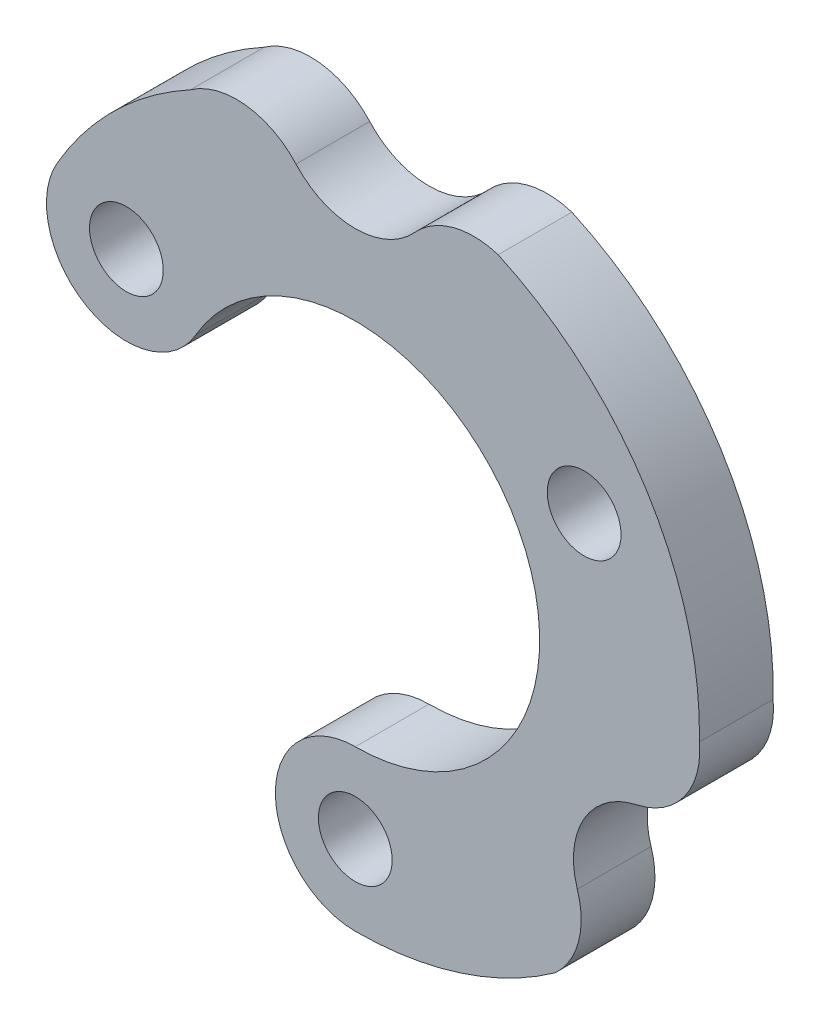
ISO-10303-21;
HEADER;
FILE_DESCRIPTION(('STEP AP214'),'2;1');
FILE_NAME('part.step','',(''),(''),'','','');
FILE_SCHEMA(('AUTOMOTIVE_DESIGN { 1 0 10303 214 1 1 1 1 }'));
ENDSEC;
DATA;
#1=APPLICATION_CONTEXT('core data for automotive mechanical design processes');
#2=APPLICATION_PROTOCOL_DEFINITION('international standard','automotive_design',2000,#1);
#3=PRODUCT_CONTEXT('',#1,'mechanical');
#4=PRODUCT('Part','Part','',(#3));
#5=PRODUCT_RELATED_PRODUCT_CATEGORY('part','',(#4));
#6=PRODUCT_DEFINITION_FORMATION('','',#4);
#7=PRODUCT_DEFINITION_CONTEXT('part definition',#1,'design');
#8=PRODUCT_DEFINITION('design','',#6,#7);
#9=PRODUCT_DEFINITION_SHAPE('','',#8);
#10=(LENGTH_UNIT() NAMED_UNIT(*) SI_UNIT(.MILLI.,.METRE.));
#11=(NAMED_UNIT(*) PLANE_ANGLE_UNIT() SI_UNIT($,.RADIAN.));
#12=(NAMED_UNIT(*) SI_UNIT($,.STERADIAN.) SOLID_ANGLE_UNIT());
#13=UNCERTAINTY_MEASURE_WITH_UNIT(LENGTH_MEASURE(1.E-05),#10,'distance_accuracy_value','');
#14=(GEOMETRIC_REPRESENTATION_CONTEXT(3) GLOBAL_UNCERTAINTY_ASSIGNED_CONTEXT((#13)) GLOBAL_UNIT_ASSIGNED_CONTEXT((#10,
#11,#12)) REPRESENTATION_CONTEXT('',''));
#15=CARTESIAN_POINT('',(0.,0.,0.));
#16=DIRECTION('',(0.,0.,1.));
#17=DIRECTION('',(1.,0.,0.));
#18=AXIS2_PLACEMENT_3D('',#15,#16,#17);
#19=CARTESIAN_POINT('',(5.38035373757222,-0.322325392410559,3.));
#20=DIRECTION('',(0.,0.,1.));
#21=DIRECTION('',(1.,0.,0.));
#22=AXIS2_PLACEMENT_3D('',#19,#20,#21);
#23=PLANE('',#22);
#24=CARTESIAN_POINT('',(0.,-10.75,3.));
#25=DIRECTION('',(0.,0.,1.));
#26=DIRECTION('',(1.,0.,0.));
#27=AXIS2_PLACEMENT_3D('',#24,#25,#26);
#28=CIRCLE('',#27,1.5);
#29=CARTESIAN_POINT('',(1.5,-10.75,3.));
#30=VERTEX_POINT('',#29);
#31=EDGE_CURVE('E286',#30,#30,#28,.T.);
#32=ORIENTED_EDGE('',*,*,#31,.F.);
#33=EDGE_LOOP('',(#32));
#34=FACE_BOUND('',#33,.T.);
#35=CARTESIAN_POINT('',(10.7607074751444,-0.644650784821117,3.));
#36=DIRECTION('',(0.,0.,1.));
#37=DIRECTION('',(1.,0.,0.));
#38=AXIS2_PLACEMENT_3D('',#35,#36,#37);
#39=CIRCLE('',#38,3.25);
#40=CARTESIAN_POINT('',(11.4425315640548,-3.82232539242045,3.));
#41=VERTEX_POINT('',#40);
#42=CARTESIAN_POINT('',(13.9959775932843,-0.335575935195618,3.));
#43=VERTEX_POINT('',#42);
#44=EDGE_CURVE('E177',#41,#43,#39,.T.);
#45=ORIENTED_EDGE('',*,*,#44,.T.);
#46=CARTESIAN_POINT('',(0.,0.,3.));
#47=DIRECTION('',(0.,0.,1.));
#48=DIRECTION('',(1.,0.,0.));
#49=AXIS2_PLACEMENT_3D('',#46,#47,#48);
#50=CIRCLE('',#49,14.);
#51=CARTESIAN_POINT('',(5.80943087987062,12.7377593340432,3.));
#52=VERTEX_POINT('',#51);
#53=EDGE_CURVE('E105',#43,#52,#50,.T.);
#54=ORIENTED_EDGE('',*,*,#53,.T.);
#55=CARTESIAN_POINT('',(4.82206978136234,9.64137142857136,3.));
#56=DIRECTION('',(0.,0.,1.));
#57=DIRECTION('',(1.,0.,0.));
#58=AXIS2_PLACEMENT_3D('',#55,#56,#57);
#59=CIRCLE('',#58,3.25);
#60=CARTESIAN_POINT('',(2.41103489067909,11.8206857142833,3.));
#61=VERTEX_POINT('',#60);
#62=EDGE_CURVE('E204',#52,#61,#59,.T.);
#63=ORIENTED_EDGE('',*,*,#62,.T.);
#64=CARTESIAN_POINT('',(1.07437023516552E-11,13.9999999999817,3.));
#65=DIRECTION('',(0.,0.,-1.));
#66=DIRECTION('',(1.,0.,0.));
#67=AXIS2_PLACEMENT_3D('',#64,#65,#66);
#68=CIRCLE('',#67,3.24999999997992);
#69=CARTESIAN_POINT('',(-2.41103489066096,11.820685714287,3.));
#70=VERTEX_POINT('',#69);
#71=EDGE_CURVE('E223',#61,#70,#68,.T.);
#72=ORIENTED_EDGE('',*,*,#71,.T.);
#73=CARTESIAN_POINT('',(-4.82206978134755,9.64137142857876,3.));
#74=DIRECTION('',(0.,0.,1.));
#75=DIRECTION('',(1.,0.,0.));
#76=AXIS2_PLACEMENT_3D('',#73,#74,#75);
#77=CIRCLE('',#76,3.25);
#78=CARTESIAN_POINT('',(-6.70737151186402,12.2886601141799,3.));
#79=VERTEX_POINT('',#78);
#80=EDGE_CURVE('E220',#70,#79,#77,.T.);
#81=ORIENTED_EDGE('',*,*,#80,.T.);
#82=CARTESIAN_POINT('',(0.,0.,3.));
#83=DIRECTION('',(0.,0.,1.));
#84=DIRECTION('',(1.,0.,0.));
#85=AXIS2_PLACEMENT_3D('',#82,#83,#84);
#86=CIRCLE('',#85,14.);
#87=CARTESIAN_POINT('',(-12.1243556529822,6.99999999999988,3.));
#88=VERTEX_POINT('',#87);
#89=EDGE_CURVE('E222',#79,#88,#86,.T.);
#90=ORIENTED_EDGE('',*,*,#89,.T.);
#91=CARTESIAN_POINT('',(-9.30977309068277,5.37499999999991,3.));
#92=DIRECTION('',(0.,0.,1.));
#93=DIRECTION('',(1.,0.,0.));
#94=AXIS2_PLACEMENT_3D('',#91,#92,#93);
#95=CIRCLE('',#94,3.25);
#96=CARTESIAN_POINT('',(-6.49519052838333,3.74999999999993,3.));
#97=VERTEX_POINT('',#96);
#98=EDGE_CURVE('E225',#88,#97,#95,.T.);
#99=ORIENTED_EDGE('',*,*,#98,.T.);
#100=CARTESIAN_POINT('',(0.,0.,3.));
#101=DIRECTION('',(0.,0.,-1.));
#102=DIRECTION('',(1.,0.,0.));
#103=AXIS2_PLACEMENT_3D('',#100,#101,#102);
#104=CIRCLE('',#103,7.5);
#105=CARTESIAN_POINT('',(0.,-7.5,3.));
#106=VERTEX_POINT('',#105);
#107=EDGE_CURVE('E231',#97,#106,#104,.T.);
#108=ORIENTED_EDGE('',*,*,#107,.T.);
#109=CARTESIAN_POINT('',(0.,-10.75,3.));
#110=DIRECTION('',(0.,0.,1.));
#111=DIRECTION('',(1.,0.,0.));
#112=AXIS2_PLACEMENT_3D('',#109,#110,#111);
#113=CIRCLE('',#112,3.25);
#114=CARTESIAN_POINT('',(0.,-14.,3.));
#115=VERTEX_POINT('',#114);
#116=EDGE_CURVE('E136',#106,#115,#113,.T.);
#117=ORIENTED_EDGE('',*,*,#116,.T.);
#118=CARTESIAN_POINT('',(0.,0.,3.));
#119=DIRECTION('',(0.,0.,1.));
#120=DIRECTION('',(1.,0.,0.));
#121=AXIS2_PLACEMENT_3D('',#118,#119,#120);
#122=CIRCLE('',#121,14.);
#123=CARTESIAN_POINT('',(8.12650773063849,-11.3999943905194,3.));
#124=VERTEX_POINT('',#123);
#125=EDGE_CURVE('E130',#115,#124,#122,.T.);
#126=ORIENTED_EDGE('',*,*,#125,.T.);
#127=CARTESIAN_POINT('',(5.93863769378309,-8.99672064376674,3.));
#128=DIRECTION('',(0.,0.,1.));
#129=DIRECTION('',(1.,0.,0.));
#130=AXIS2_PLACEMENT_3D('',#127,#128,#129);
#131=CIRCLE('',#130,3.25);
#132=CARTESIAN_POINT('',(9.03149667338157,-7.99836032188037,3.));
#133=VERTEX_POINT('',#132);
#134=EDGE_CURVE('E134',#124,#133,#131,.T.);
#135=ORIENTED_EDGE('',*,*,#134,.T.);
#136=CARTESIAN_POINT('',(12.124355652961,-7.00000000000017,3.));
#137=DIRECTION('',(0.,0.,-1.));
#138=DIRECTION('',(1.,0.,0.));
#139=AXIS2_PLACEMENT_3D('',#136,#137,#138);
#140=CIRCLE('',#139,3.24999999997994);
#141=EDGE_CURVE('E50',#133,#41,#140,.T.);
#142=ORIENTED_EDGE('',*,*,#141,.T.);
#143=EDGE_LOOP('',(#45,#54,#63,#72,#81,#90,#99,#108,#117,#126,#135,#142));
#144=FACE_BOUND('',#143,.T.);
#145=CARTESIAN_POINT('',(9.30977309068262,5.37500000000017,3.));
#146=DIRECTION('',(0.,0.,1.));
#147=DIRECTION('',(1.,0.,0.));
#148=AXIS2_PLACEMENT_3D('',#145,#146,#147);
#149=CIRCLE('',#148,1.5);
#150=CARTESIAN_POINT('',(10.8097730906826,5.37500000000017,3.));
#151=VERTEX_POINT('',#150);
#152=EDGE_CURVE('E158',#151,#151,#149,.T.);
#153=ORIENTED_EDGE('',*,*,#152,.F.);
#154=EDGE_LOOP('',(#153));
#155=FACE_BOUND('',#154,.T.);
#156=CARTESIAN_POINT('',(-9.30977309068277,5.37499999999991,3.));
#157=DIRECTION('',(0.,0.,1.));
#158=DIRECTION('',(1.,0.,0.));
#159=AXIS2_PLACEMENT_3D('',#156,#157,#158);
#160=CIRCLE('',#159,1.5);
#161=CARTESIAN_POINT('',(-7.80977309068277,5.37499999999991,3.));
#162=VERTEX_POINT('',#161);
#163=EDGE_CURVE('E277',#162,#162,#160,.T.);
#164=ORIENTED_EDGE('',*,*,#163,.F.);
#165=EDGE_LOOP('',(#164));
#166=FACE_BOUND('',#165,.T.);
#167=ADVANCED_FACE('F33',(#34,#144,#155,#166),#23,.T.);
#168=CARTESIAN_POINT('',(5.38035373757222,-0.322325392410559,0.));
#169=DIRECTION('',(0.,0.,1.));
#170=DIRECTION('',(1.,0.,0.));
#171=AXIS2_PLACEMENT_3D('',#168,#169,#170);
#172=PLANE('',#171);
#173=CARTESIAN_POINT('',(10.7607074751444,-0.644650784821117,0.));
#174=DIRECTION('',(0.,0.,1.));
#175=DIRECTION('',(1.,0.,0.));
#176=AXIS2_PLACEMENT_3D('',#173,#174,#175);
#177=CIRCLE('',#176,3.25);
#178=CARTESIAN_POINT('',(11.4425315640548,-3.82232539242045,0.));
#179=VERTEX_POINT('',#178);
#180=CARTESIAN_POINT('',(13.9959775932843,-0.335575935195618,0.));
#181=VERTEX_POINT('',#180);
#182=EDGE_CURVE('E154',#179,#181,#177,.T.);
#183=ORIENTED_EDGE('',*,*,#182,.F.);
#184=CARTESIAN_POINT('',(12.124355652961,-7.00000000000017,0.));
#185=DIRECTION('',(0.,0.,-1.));
#186=DIRECTION('',(1.,0.,0.));
#187=AXIS2_PLACEMENT_3D('',#184,#185,#186);
#188=CIRCLE('',#187,3.24999999997994);
#189=CARTESIAN_POINT('',(9.03149667338157,-7.99836032188037,0.));
#190=VERTEX_POINT('',#189);
#191=EDGE_CURVE('E97',#190,#179,#188,.T.);
#192=ORIENTED_EDGE('',*,*,#191,.F.);
#193=CARTESIAN_POINT('',(5.93863769378309,-8.99672064376674,0.));
#194=DIRECTION('',(0.,0.,1.));
#195=DIRECTION('',(1.,0.,0.));
#196=AXIS2_PLACEMENT_3D('',#193,#194,#195);
#197=CIRCLE('',#196,3.25);
#198=CARTESIAN_POINT('',(8.12650773063849,-11.3999943905194,0.));
#199=VERTEX_POINT('',#198);
#200=EDGE_CURVE('E91',#199,#190,#197,.T.);
#201=ORIENTED_EDGE('',*,*,#200,.F.);
#202=CARTESIAN_POINT('',(0.,0.,0.));
#203=DIRECTION('',(0.,0.,1.));
#204=DIRECTION('',(1.,0.,0.));
#205=AXIS2_PLACEMENT_3D('',#202,#203,#204);
#206=CIRCLE('',#205,14.);
#207=CARTESIAN_POINT('',(0.,-14.,0.));
#208=VERTEX_POINT('',#207);
#209=EDGE_CURVE('E144',#208,#199,#206,.T.);
#210=ORIENTED_EDGE('',*,*,#209,.F.);
#211=CARTESIAN_POINT('',(0.,-10.75,0.));
#212=DIRECTION('',(0.,0.,1.));
#213=DIRECTION('',(1.,0.,0.));
#214=AXIS2_PLACEMENT_3D('',#211,#212,#213);
#215=CIRCLE('',#214,3.25);
#216=CARTESIAN_POINT('',(0.,-7.5,0.));
#217=VERTEX_POINT('',#216);
#218=EDGE_CURVE('E172',#217,#208,#215,.T.);
#219=ORIENTED_EDGE('',*,*,#218,.F.);
#220=CARTESIAN_POINT('',(0.,0.,0.));
#221=DIRECTION('',(0.,0.,-1.));
#222=DIRECTION('',(1.,0.,0.));
#223=AXIS2_PLACEMENT_3D('',#220,#221,#222);
#224=CIRCLE('',#223,7.5);
#225=CARTESIAN_POINT('',(-6.49519052838333,3.74999999999993,0.));
#226=VERTEX_POINT('',#225);
#227=EDGE_CURVE('E170',#226,#217,#224,.T.);
#228=ORIENTED_EDGE('',*,*,#227,.F.);
#229=CARTESIAN_POINT('',(-9.30977309068277,5.37499999999991,0.));
#230=DIRECTION('',(0.,0.,1.));
#231=DIRECTION('',(1.,0.,0.));
#232=AXIS2_PLACEMENT_3D('',#229,#230,#231);
#233=CIRCLE('',#232,3.25);
#234=CARTESIAN_POINT('',(-12.1243556529822,6.99999999999988,0.));
#235=VERTEX_POINT('',#234);
#236=EDGE_CURVE('E168',#235,#226,#233,.T.);
#237=ORIENTED_EDGE('',*,*,#236,.F.);
#238=CARTESIAN_POINT('',(0.,0.,0.));
#239=DIRECTION('',(0.,0.,1.));
#240=DIRECTION('',(1.,0.,0.));
#241=AXIS2_PLACEMENT_3D('',#238,#239,#240);
#242=CIRCLE('',#241,14.);
#243=CARTESIAN_POINT('',(-6.70737151186402,12.2886601141799,0.));
#244=VERTEX_POINT('',#243);
#245=EDGE_CURVE('E166',#244,#235,#242,.T.);
#246=ORIENTED_EDGE('',*,*,#245,.F.);
#247=CARTESIAN_POINT('',(-4.82206978134755,9.64137142857876,0.));
#248=DIRECTION('',(0.,0.,1.));
#249=DIRECTION('',(1.,0.,0.));
#250=AXIS2_PLACEMENT_3D('',#247,#248,#249);
#251=CIRCLE('',#250,3.25);
#252=CARTESIAN_POINT('',(-2.41103489066096,11.820685714287,0.));
#253=VERTEX_POINT('',#252);
#254=EDGE_CURVE('E164',#253,#244,#251,.T.);
#255=ORIENTED_EDGE('',*,*,#254,.F.);
#256=CARTESIAN_POINT('',(1.07437023516552E-11,13.9999999999817,0.));
#257=DIRECTION('',(0.,0.,-1.));
#258=DIRECTION('',(1.,0.,0.));
#259=AXIS2_PLACEMENT_3D('',#256,#257,#258);
#260=CIRCLE('',#259,3.24999999997992);
#261=CARTESIAN_POINT('',(2.41103489067909,11.8206857142833,0.));
#262=VERTEX_POINT('',#261);
#263=EDGE_CURVE('E162',#262,#253,#260,.T.);
#264=ORIENTED_EDGE('',*,*,#263,.F.);
#265=CARTESIAN_POINT('',(4.82206978136234,9.64137142857136,0.));
#266=DIRECTION('',(0.,0.,1.));
#267=DIRECTION('',(1.,0.,0.));
#268=AXIS2_PLACEMENT_3D('',#265,#266,#267);
#269=CIRCLE('',#268,3.25);
#270=CARTESIAN_POINT('',(5.80943087987062,12.7377593340432,0.));
#271=VERTEX_POINT('',#270);
#272=EDGE_CURVE('E160',#271,#262,#269,.T.);
#273=ORIENTED_EDGE('',*,*,#272,.F.);
#274=CARTESIAN_POINT('',(0.,0.,0.));
#275=DIRECTION('',(0.,0.,1.));
#276=DIRECTION('',(1.,0.,0.));
#277=AXIS2_PLACEMENT_3D('',#274,#275,#276);
#278=CIRCLE('',#277,14.);
#279=EDGE_CURVE('E157',#181,#271,#278,.T.);
#280=ORIENTED_EDGE('',*,*,#279,.F.);
#281=EDGE_LOOP('',(#183,#192,#201,#210,#219,#228,#237,#246,#255,#264,#273,#280));
#282=FACE_BOUND('',#281,.T.);
#283=CARTESIAN_POINT('',(9.30977309068262,5.37500000000017,0.));
#284=DIRECTION('',(0.,0.,1.));
#285=DIRECTION('',(1.,0.,0.));
#286=AXIS2_PLACEMENT_3D('',#283,#284,#285);
#287=CIRCLE('',#286,1.5);
#288=CARTESIAN_POINT('',(10.8097730906826,5.37500000000017,0.));
#289=VERTEX_POINT('',#288);
#290=EDGE_CURVE('E289',#289,#289,#287,.T.);
#291=ORIENTED_EDGE('',*,*,#290,.T.);
#292=EDGE_LOOP('',(#291));
#293=FACE_BOUND('',#292,.T.);
#294=CARTESIAN_POINT('',(0.,-10.75,0.));
#295=DIRECTION('',(0.,0.,1.));
#296=DIRECTION('',(1.,0.,0.));
#297=AXIS2_PLACEMENT_3D('',#294,#295,#296);
#298=CIRCLE('',#297,1.5);
#299=CARTESIAN_POINT('',(1.5,-10.75,0.));
#300=VERTEX_POINT('',#299);
#301=EDGE_CURVE('E283',#300,#300,#298,.T.);
#302=ORIENTED_EDGE('',*,*,#301,.T.);
#303=EDGE_LOOP('',(#302));
#304=FACE_BOUND('',#303,.T.);
#305=CARTESIAN_POINT('',(-9.30977309068277,5.37499999999991,0.));
#306=DIRECTION('',(0.,0.,1.));
#307=DIRECTION('',(1.,0.,0.));
#308=AXIS2_PLACEMENT_3D('',#305,#306,#307);
#309=CIRCLE('',#308,1.5);
#310=CARTESIAN_POINT('',(-7.80977309068277,5.37499999999991,0.));
#311=VERTEX_POINT('',#310);
#312=EDGE_CURVE('E280',#311,#311,#309,.T.);
#313=ORIENTED_EDGE('',*,*,#312,.T.);
#314=EDGE_LOOP('',(#313));
#315=FACE_BOUND('',#314,.T.);
#316=ADVANCED_FACE('F208',(#282,#293,#304,#315),#172,.F.);
#317=CARTESIAN_POINT('',(10.7607074751444,-0.644650784821117,3.));
#318=DIRECTION('',(0.,0.,-1.));
#319=DIRECTION('',(-1.,0.,0.));
#320=AXIS2_PLACEMENT_3D('',#317,#318,#319);
#321=CYLINDRICAL_SURFACE('',#320,3.25);
#322=ORIENTED_EDGE('',*,*,#182,.T.);
#323=DIRECTION('',(0.,0.,-1.));
#324=VECTOR('',#323,1.);
#325=CARTESIAN_POINT('',(13.9959775932843,-0.335575935195618,3.));
#326=LINE('',#325,#324);
#327=EDGE_CURVE('E11',#43,#181,#326,.T.);
#328=ORIENTED_EDGE('',*,*,#327,.F.);
#329=ORIENTED_EDGE('',*,*,#44,.F.);
#330=DIRECTION('',(0.,0.,-1.));
#331=VECTOR('',#330,1.);
#332=CARTESIAN_POINT('',(11.4425315640548,-3.82232539242045,3.));
#333=LINE('',#332,#331);
#334=EDGE_CURVE('E150',#41,#179,#333,.T.);
#335=ORIENTED_EDGE('',*,*,#334,.T.);
#336=EDGE_LOOP('',(#322,#328,#329,#335));
#337=FACE_BOUND('',#336,.T.);
#338=ADVANCED_FACE('F35',(#337),#321,.T.);
#339=CARTESIAN_POINT('',(0.,0.,3.));
#340=DIRECTION('',(0.,0.,-1.));
#341=DIRECTION('',(-1.,0.,0.));
#342=AXIS2_PLACEMENT_3D('',#339,#340,#341);
#343=CYLINDRICAL_SURFACE('',#342,14.);
#344=ORIENTED_EDGE('',*,*,#279,.T.);
#345=DIRECTION('',(0.,0.,-1.));
#346=VECTOR('',#345,1.);
#347=CARTESIAN_POINT('',(5.80943087987062,12.7377593340432,3.));
#348=LINE('',#347,#346);
#349=EDGE_CURVE('E42',#52,#271,#348,.T.);
#350=ORIENTED_EDGE('',*,*,#349,.F.);
#351=ORIENTED_EDGE('',*,*,#53,.F.);
#352=ORIENTED_EDGE('',*,*,#327,.T.);
#353=EDGE_LOOP('',(#344,#350,#351,#352));
#354=FACE_BOUND('',#353,.T.);
#355=ADVANCED_FACE('F391',(#354),#343,.T.);
#356=CARTESIAN_POINT('',(4.82206978136234,9.64137142857136,3.));
#357=DIRECTION('',(0.,0.,-1.));
#358=DIRECTION('',(-1.,0.,0.));
#359=AXIS2_PLACEMENT_3D('',#356,#357,#358);
#360=CYLINDRICAL_SURFACE('',#359,3.25);
#361=ORIENTED_EDGE('',*,*,#272,.T.);
#362=DIRECTION('',(0.,0.,-1.));
#363=VECTOR('',#362,1.);
#364=CARTESIAN_POINT('',(2.41103489067909,11.8206857142833,3.));
#365=LINE('',#364,#363);
#366=EDGE_CURVE('E196',#61,#262,#365,.T.);
#367=ORIENTED_EDGE('',*,*,#366,.F.);
#368=ORIENTED_EDGE('',*,*,#62,.F.);
#369=ORIENTED_EDGE('',*,*,#349,.T.);
#370=EDGE_LOOP('',(#361,#367,#368,#369));
#371=FACE_BOUND('',#370,.T.);
#372=ADVANCED_FACE('F202',(#371),#360,.T.);
#373=CARTESIAN_POINT('',(1.07437023516552E-11,13.9999999999817,3.));
#374=DIRECTION('',(0.,0.,-1.));
#375=DIRECTION('',(-1.,0.,0.));
#376=AXIS2_PLACEMENT_3D('',#373,#374,#375);
#377=CYLINDRICAL_SURFACE('',#376,3.24999999997992);
#378=ORIENTED_EDGE('',*,*,#263,.T.);
#379=DIRECTION('',(0.,0.,-1.));
#380=VECTOR('',#379,1.);
#381=CARTESIAN_POINT('',(-2.41103489066096,11.820685714287,3.));
#382=LINE('',#381,#380);
#383=EDGE_CURVE('E193',#70,#253,#382,.T.);
#384=ORIENTED_EDGE('',*,*,#383,.F.);
#385=ORIENTED_EDGE('',*,*,#71,.F.);
#386=ORIENTED_EDGE('',*,*,#366,.T.);
#387=EDGE_LOOP('',(#378,#384,#385,#386));
#388=FACE_BOUND('',#387,.T.);
#389=ADVANCED_FACE('F214',(#388),#377,.F.);
#390=CARTESIAN_POINT('',(-4.82206978134755,9.64137142857876,3.));
#391=DIRECTION('',(0.,0.,-1.));
#392=DIRECTION('',(-1.,0.,0.));
#393=AXIS2_PLACEMENT_3D('',#390,#391,#392);
#394=CYLINDRICAL_SURFACE('',#393,3.25);
#395=ORIENTED_EDGE('',*,*,#254,.T.);
#396=DIRECTION('',(0.,0.,-1.));
#397=VECTOR('',#396,1.);
#398=CARTESIAN_POINT('',(-6.70737151186402,12.2886601141799,3.));
#399=LINE('',#398,#397);
#400=EDGE_CURVE('E190',#79,#244,#399,.T.);
#401=ORIENTED_EDGE('',*,*,#400,.F.);
#402=ORIENTED_EDGE('',*,*,#80,.F.);
#403=ORIENTED_EDGE('',*,*,#383,.T.);
#404=EDGE_LOOP('',(#395,#401,#402,#403));
#405=FACE_BOUND('',#404,.T.);
#406=ADVANCED_FACE('F218',(#405),#394,.T.);
#407=CARTESIAN_POINT('',(0.,0.,3.));
#408=DIRECTION('',(0.,0.,-1.));
#409=DIRECTION('',(-1.,0.,0.));
#410=AXIS2_PLACEMENT_3D('',#407,#408,#409);
#411=CYLINDRICAL_SURFACE('',#410,14.);
#412=ORIENTED_EDGE('',*,*,#245,.T.);
#413=DIRECTION('',(0.,0.,-1.));
#414=VECTOR('',#413,1.);
#415=CARTESIAN_POINT('',(-12.1243556529822,6.99999999999988,3.));
#416=LINE('',#415,#414);
#417=EDGE_CURVE('E187',#88,#235,#416,.T.);
#418=ORIENTED_EDGE('',*,*,#417,.F.);
#419=ORIENTED_EDGE('',*,*,#89,.F.);
#420=ORIENTED_EDGE('',*,*,#400,.T.);
#421=EDGE_LOOP('',(#412,#418,#419,#420));
#422=FACE_BOUND('',#421,.T.);
#423=ADVANCED_FACE('F356',(#422),#411,.T.);
#424=CARTESIAN_POINT('',(-9.30977309068277,5.37499999999991,3.));
#425=DIRECTION('',(0.,0.,-1.));
#426=DIRECTION('',(-1.,0.,0.));
#427=AXIS2_PLACEMENT_3D('',#424,#425,#426);
#428=CYLINDRICAL_SURFACE('',#427,3.25);
#429=ORIENTED_EDGE('',*,*,#236,.T.);
#430=DIRECTION('',(0.,0.,-1.));
#431=VECTOR('',#430,1.);
#432=CARTESIAN_POINT('',(-6.49519052838333,3.74999999999993,3.));
#433=LINE('',#432,#431);
#434=EDGE_CURVE('E184',#97,#226,#433,.T.);
#435=ORIENTED_EDGE('',*,*,#434,.F.);
#436=ORIENTED_EDGE('',*,*,#98,.F.);
#437=ORIENTED_EDGE('',*,*,#417,.T.);
#438=EDGE_LOOP('',(#429,#435,#436,#437));
#439=FACE_BOUND('',#438,.T.);
#440=ADVANCED_FACE('F347',(#439),#428,.T.);
#441=CARTESIAN_POINT('',(0.,0.,3.));
#442=DIRECTION('',(0.,0.,-1.));
#443=DIRECTION('',(-1.,0.,0.));
#444=AXIS2_PLACEMENT_3D('',#441,#442,#443);
#445=CYLINDRICAL_SURFACE('',#444,7.5);
#446=ORIENTED_EDGE('',*,*,#227,.T.);
#447=DIRECTION('',(0.,0.,-1.));
#448=VECTOR('',#447,1.);
#449=CARTESIAN_POINT('',(0.,-7.5,3.));
#450=LINE('',#449,#448);
#451=EDGE_CURVE('E181',#106,#217,#450,.T.);
#452=ORIENTED_EDGE('',*,*,#451,.F.);
#453=ORIENTED_EDGE('',*,*,#107,.F.);
#454=ORIENTED_EDGE('',*,*,#434,.T.);
#455=EDGE_LOOP('',(#446,#452,#453,#454));
#456=FACE_BOUND('',#455,.T.);
#457=ADVANCED_FACE('F237',(#456),#445,.F.);
#458=CARTESIAN_POINT('',(0.,-10.75,3.));
#459=DIRECTION('',(0.,0.,-1.));
#460=DIRECTION('',(-1.,0.,0.));
#461=AXIS2_PLACEMENT_3D('',#458,#459,#460);
#462=CYLINDRICAL_SURFACE('',#461,3.25);
#463=ORIENTED_EDGE('',*,*,#218,.T.);
#464=DIRECTION('',(0.,0.,-1.));
#465=VECTOR('',#464,1.);
#466=CARTESIAN_POINT('',(0.,-14.,3.));
#467=LINE('',#466,#465);
#468=EDGE_CURVE('E145',#115,#208,#467,.T.);
#469=ORIENTED_EDGE('',*,*,#468,.F.);
#470=ORIENTED_EDGE('',*,*,#116,.F.);
#471=ORIENTED_EDGE('',*,*,#451,.T.);
#472=EDGE_LOOP('',(#463,#469,#470,#471));
#473=FACE_BOUND('',#472,.T.);
#474=ADVANCED_FACE('F241',(#473),#462,.T.);
#475=CARTESIAN_POINT('',(0.,0.,3.));
#476=DIRECTION('',(0.,0.,-1.));
#477=DIRECTION('',(-1.,0.,0.));
#478=AXIS2_PLACEMENT_3D('',#475,#476,#477);
#479=CYLINDRICAL_SURFACE('',#478,14.);
#480=ORIENTED_EDGE('',*,*,#209,.T.);
#481=DIRECTION('',(0.,0.,-1.));
#482=VECTOR('',#481,1.);
#483=CARTESIAN_POINT('',(8.12650773063849,-11.3999943905194,3.));
#484=LINE('',#483,#482);
#485=EDGE_CURVE('E141',#124,#199,#484,.T.);
#486=ORIENTED_EDGE('',*,*,#485,.F.);
#487=ORIENTED_EDGE('',*,*,#125,.F.);
#488=ORIENTED_EDGE('',*,*,#468,.T.);
#489=EDGE_LOOP('',(#480,#486,#487,#488));
#490=FACE_BOUND('',#489,.T.);
#491=ADVANCED_FACE('F142',(#490),#479,.T.);
#492=CARTESIAN_POINT('',(5.93863769378309,-8.99672064376674,3.));
#493=DIRECTION('',(0.,0.,-1.));
#494=DIRECTION('',(-1.,0.,0.));
#495=AXIS2_PLACEMENT_3D('',#492,#493,#494);
#496=CYLINDRICAL_SURFACE('',#495,3.25);
#497=ORIENTED_EDGE('',*,*,#200,.T.);
#498=DIRECTION('',(0.,0.,-1.));
#499=VECTOR('',#498,1.);
#500=CARTESIAN_POINT('',(9.03149667338157,-7.99836032188037,3.));
#501=LINE('',#500,#499);
#502=EDGE_CURVE('E146',#133,#190,#501,.T.);
#503=ORIENTED_EDGE('',*,*,#502,.F.);
#504=ORIENTED_EDGE('',*,*,#134,.F.);
#505=ORIENTED_EDGE('',*,*,#485,.T.);
#506=EDGE_LOOP('',(#497,#503,#504,#505));
#507=FACE_BOUND('',#506,.T.);
#508=ADVANCED_FACE('F148',(#507),#496,.T.);
#509=CARTESIAN_POINT('',(12.124355652961,-7.00000000000017,3.));
#510=DIRECTION('',(0.,0.,-1.));
#511=DIRECTION('',(-1.,0.,0.));
#512=AXIS2_PLACEMENT_3D('',#509,#510,#511);
#513=CYLINDRICAL_SURFACE('',#512,3.24999999997994);
#514=ORIENTED_EDGE('',*,*,#191,.T.);
#515=ORIENTED_EDGE('',*,*,#334,.F.);
#516=ORIENTED_EDGE('',*,*,#141,.F.);
#517=ORIENTED_EDGE('',*,*,#502,.T.);
#518=EDGE_LOOP('',(#514,#515,#516,#517));
#519=FACE_BOUND('',#518,.T.);
#520=ADVANCED_FACE('F245',(#519),#513,.F.);
#521=CARTESIAN_POINT('',(9.30977309068262,5.37500000000017,3.));
#522=DIRECTION('',(0.,0.,-1.));
#523=DIRECTION('',(-1.,0.,0.));
#524=AXIS2_PLACEMENT_3D('',#521,#522,#523);
#525=CYLINDRICAL_SURFACE('',#524,1.5);
#526=ORIENTED_EDGE('',*,*,#152,.T.);
#527=EDGE_LOOP('',(#526));
#528=FACE_BOUND('',#527,.T.);
#529=ORIENTED_EDGE('',*,*,#290,.F.);
#530=EDGE_LOOP('',(#529));
#531=FACE_BOUND('',#530,.T.);
#532=ADVANCED_FACE('F247',(#528,#531),#525,.F.);
#533=CARTESIAN_POINT('',(0.,-10.75,3.));
#534=DIRECTION('',(0.,0.,-1.));
#535=DIRECTION('',(-1.,0.,0.));
#536=AXIS2_PLACEMENT_3D('',#533,#534,#535);
#537=CYLINDRICAL_SURFACE('',#536,1.5);
#538=ORIENTED_EDGE('',*,*,#31,.T.);
#539=EDGE_LOOP('',(#538));
#540=FACE_BOUND('',#539,.T.);
#541=ORIENTED_EDGE('',*,*,#301,.F.);
#542=EDGE_LOOP('',(#541));
#543=FACE_BOUND('',#542,.T.);
#544=ADVANCED_FACE('F253',(#540,#543),#537,.F.);
#545=CARTESIAN_POINT('',(-9.30977309068277,5.37499999999991,3.));
#546=DIRECTION('',(0.,0.,-1.));
#547=DIRECTION('',(-1.,0.,0.));
#548=AXIS2_PLACEMENT_3D('',#545,#546,#547);
#549=CYLINDRICAL_SURFACE('',#548,1.5);
#550=ORIENTED_EDGE('',*,*,#163,.T.);
#551=EDGE_LOOP('',(#550));
#552=FACE_BOUND('',#551,.T.);
#553=ORIENTED_EDGE('',*,*,#312,.F.);
#554=EDGE_LOOP('',(#553));
#555=FACE_BOUND('',#554,.T.);
#556=ADVANCED_FACE('F268',(#552,#555),#549,.F.);
#557=CLOSED_SHELL('',(#167,#316,#338,#355,#372,#389,#406,#423,#440,#457,#474,#491,#508,#520,
#532,#544,#556));
#558=MANIFOLD_SOLID_BREP('B2',#557);
#559=ADVANCED_BREP_SHAPE_REPRESENTATION('',(#18,#558),#14);
#560=SHAPE_DEFINITION_REPRESENTATION(#9,#559);
ENDSEC;
END-ISO-10303-21;
